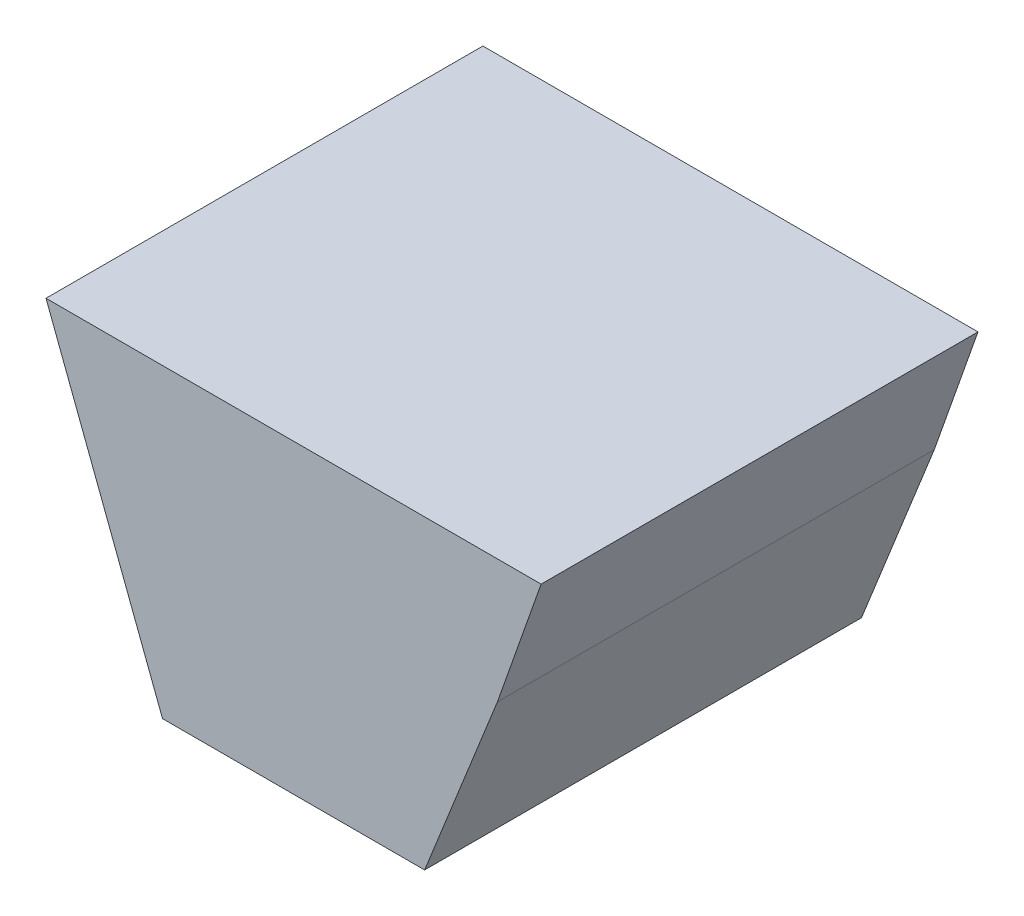
ISO-10303-21;
HEADER;
FILE_DESCRIPTION(('STEP AP214'),'2;1');
FILE_NAME('part.step','',(''),(''),'','','');
FILE_SCHEMA(('AUTOMOTIVE_DESIGN { 1 0 10303 214 1 1 1 1 }'));
ENDSEC;
DATA;
#1=APPLICATION_CONTEXT('core data for automotive mechanical design processes');
#2=APPLICATION_PROTOCOL_DEFINITION('international standard','automotive_design',2000,#1);
#3=PRODUCT_CONTEXT('',#1,'mechanical');
#4=PRODUCT('Part','Part','',(#3));
#5=PRODUCT_RELATED_PRODUCT_CATEGORY('part','',(#4));
#6=PRODUCT_DEFINITION_FORMATION('','',#4);
#7=PRODUCT_DEFINITION_CONTEXT('part definition',#1,'design');
#8=PRODUCT_DEFINITION('design','',#6,#7);
#9=PRODUCT_DEFINITION_SHAPE('','',#8);
#10=(LENGTH_UNIT() NAMED_UNIT(*) SI_UNIT(.MILLI.,.METRE.));
#11=(NAMED_UNIT(*) PLANE_ANGLE_UNIT() SI_UNIT($,.RADIAN.));
#12=(NAMED_UNIT(*) SI_UNIT($,.STERADIAN.) SOLID_ANGLE_UNIT());
#13=UNCERTAINTY_MEASURE_WITH_UNIT(LENGTH_MEASURE(1.E-05),#10,'distance_accuracy_value','');
#14=(GEOMETRIC_REPRESENTATION_CONTEXT(3) GLOBAL_UNCERTAINTY_ASSIGNED_CONTEXT((#13)) GLOBAL_UNIT_ASSIGNED_CONTEXT((#10,
#11,#12)) REPRESENTATION_CONTEXT('',''));
#15=CARTESIAN_POINT('',(0.,0.,0.));
#16=DIRECTION('',(0.,0.,1.));
#17=DIRECTION('',(1.,0.,0.));
#18=AXIS2_PLACEMENT_3D('',#15,#16,#17);
#19=CARTESIAN_POINT('',(2.286,-2.667,0.));
#20=DIRECTION('',(0.,-1.,0.));
#21=DIRECTION('',(0.,0.,-1.));
#22=AXIS2_PLACEMENT_3D('',#19,#20,#21);
#23=PLANE('',#22);
#24=DIRECTION('',(0.,0.,1.));
#25=VECTOR('',#24,1.);
#26=CARTESIAN_POINT('',(-2.286,-2.667,0.));
#27=LINE('',#26,#25);
#28=CARTESIAN_POINT('',(-2.286,-2.667,0.));
#29=VERTEX_POINT('',#28);
#30=CARTESIAN_POINT('',(-2.286,-2.667,7.62));
#31=VERTEX_POINT('',#30);
#32=EDGE_CURVE('E66',#29,#31,#27,.T.);
#33=ORIENTED_EDGE('',*,*,#32,.F.);
#34=DIRECTION('',(1.,0.,0.));
#35=VECTOR('',#34,1.);
#36=CARTESIAN_POINT('',(4.318,-2.667,0.));
#37=LINE('',#36,#35);
#38=CARTESIAN_POINT('',(2.286,-2.667,0.));
#39=VERTEX_POINT('',#38);
#40=EDGE_CURVE('E92',#29,#39,#37,.T.);
#41=ORIENTED_EDGE('',*,*,#40,.T.);
#42=DIRECTION('',(0.,0.,1.));
#43=VECTOR('',#42,1.);
#44=CARTESIAN_POINT('',(2.286,-2.667,0.));
#45=LINE('',#44,#43);
#46=CARTESIAN_POINT('',(2.286,-2.667,7.62));
#47=VERTEX_POINT('',#46);
#48=EDGE_CURVE('E20',#47,#39,#45,.F.);
#49=ORIENTED_EDGE('',*,*,#48,.F.);
#50=DIRECTION('',(1.,0.,0.));
#51=VECTOR('',#50,1.);
#52=CARTESIAN_POINT('',(4.318,-2.667,7.62));
#53=LINE('',#52,#51);
#54=EDGE_CURVE('E75',#31,#47,#53,.T.);
#55=ORIENTED_EDGE('',*,*,#54,.F.);
#56=EDGE_LOOP('',(#33,#41,#49,#55));
#57=FACE_BOUND('',#56,.T.);
#58=ADVANCED_FACE('F17',(#57),#23,.T.);
#59=CARTESIAN_POINT('',(3.556,0.508,0.));
#60=DIRECTION('',(0.928476690885259,-0.371390676354104,0.));
#61=DIRECTION('',(0.371390676354104,0.928476690885259,0.));
#62=AXIS2_PLACEMENT_3D('',#59,#60,#61);
#63=PLANE('',#62);
#64=ORIENTED_EDGE('',*,*,#48,.T.);
#65=DIRECTION('',(0.371390676354104,0.928476690885259,0.));
#66=VECTOR('',#65,1.);
#67=CARTESIAN_POINT('',(2.286,-2.667,0.));
#68=LINE('',#67,#66);
#69=CARTESIAN_POINT('',(3.55600000000012,0.50800000000006,0.));
#70=VERTEX_POINT('',#69);
#71=EDGE_CURVE('E94',#39,#70,#68,.T.);
#72=ORIENTED_EDGE('',*,*,#71,.T.);
#73=DIRECTION('',(0.,0.,1.));
#74=VECTOR('',#73,1.);
#75=CARTESIAN_POINT('',(3.55600000000036,0.507999999999873,0.));
#76=LINE('',#75,#74);
#77=CARTESIAN_POINT('',(3.55600000000016,0.508000000000151,7.62));
#78=VERTEX_POINT('',#77);
#79=EDGE_CURVE('E89',#78,#70,#76,.F.);
#80=ORIENTED_EDGE('',*,*,#79,.F.);
#81=DIRECTION('',(0.371390676354104,0.928476690885259,0.));
#82=VECTOR('',#81,1.);
#83=CARTESIAN_POINT('',(2.286,-2.667,7.62));
#84=LINE('',#83,#82);
#85=EDGE_CURVE('E77',#47,#78,#84,.T.);
#86=ORIENTED_EDGE('',*,*,#85,.F.);
#87=EDGE_LOOP('',(#64,#72,#80,#86));
#88=FACE_BOUND('',#87,.T.);
#89=ADVANCED_FACE('F106',(#88),#63,.T.);
#90=CARTESIAN_POINT('',(-2.286,-2.667,0.));
#91=DIRECTION('',(-0.934487734928968,-0.355995327591988,0.));
#92=DIRECTION('',(0.355995327591988,-0.934487734928968,0.));
#93=AXIS2_PLACEMENT_3D('',#90,#91,#92);
#94=PLANE('',#93);
#95=DIRECTION('',(0.,0.,1.));
#96=VECTOR('',#95,1.);
#97=CARTESIAN_POINT('',(-4.318,2.667,0.));
#98=LINE('',#97,#96);
#99=CARTESIAN_POINT('',(-4.318,2.667,0.));
#100=VERTEX_POINT('',#99);
#101=CARTESIAN_POINT('',(-4.318,2.667,7.62));
#102=VERTEX_POINT('',#101);
#103=EDGE_CURVE('E97',#100,#102,#98,.T.);
#104=ORIENTED_EDGE('',*,*,#103,.F.);
#105=DIRECTION('',(0.355995327591988,-0.934487734928968,0.));
#106=VECTOR('',#105,1.);
#107=CARTESIAN_POINT('',(-4.318,2.667,0.));
#108=LINE('',#107,#106);
#109=EDGE_CURVE('E72',#100,#29,#108,.T.);
#110=ORIENTED_EDGE('',*,*,#109,.T.);
#111=ORIENTED_EDGE('',*,*,#32,.T.);
#112=DIRECTION('',(0.355995327591988,-0.934487734928968,0.));
#113=VECTOR('',#112,1.);
#114=CARTESIAN_POINT('',(-4.318,2.667,7.62));
#115=LINE('',#114,#113);
#116=EDGE_CURVE('E69',#102,#31,#115,.T.);
#117=ORIENTED_EDGE('',*,*,#116,.F.);
#118=EDGE_LOOP('',(#104,#110,#111,#117));
#119=FACE_BOUND('',#118,.T.);
#120=ADVANCED_FACE('F67',(#119),#94,.T.);
#121=CARTESIAN_POINT('',(4.318,2.667,7.62));
#122=DIRECTION('',(0.,0.,1.));
#123=DIRECTION('',(1.,0.,0.));
#124=AXIS2_PLACEMENT_3D('',#121,#122,#123);
#125=PLANE('',#124);
#126=ORIENTED_EDGE('',*,*,#85,.T.);
#127=DIRECTION('',(0.332820117734981,0.942990333582945,0.));
#128=VECTOR('',#127,1.);
#129=CARTESIAN_POINT('',(4.318,2.667,7.62));
#130=LINE('',#129,#128);
#131=CARTESIAN_POINT('',(4.318,2.667,7.62));
#132=VERTEX_POINT('',#131);
#133=EDGE_CURVE('E86',#132,#78,#130,.F.);
#134=ORIENTED_EDGE('',*,*,#133,.F.);
#135=DIRECTION('',(1.,0.,0.));
#136=VECTOR('',#135,1.);
#137=CARTESIAN_POINT('',(-4.318,2.667,7.62));
#138=LINE('',#137,#136);
#139=EDGE_CURVE('E81',#102,#132,#138,.T.);
#140=ORIENTED_EDGE('',*,*,#139,.F.);
#141=ORIENTED_EDGE('',*,*,#116,.T.);
#142=ORIENTED_EDGE('',*,*,#54,.T.);
#143=EDGE_LOOP('',(#126,#134,#140,#141,#142));
#144=FACE_BOUND('',#143,.T.);
#145=ADVANCED_FACE('F79',(#144),#125,.T.);
#146=CARTESIAN_POINT('',(4.318,2.667,0.));
#147=DIRECTION('',(0.942990333582945,-0.332820117734981,0.));
#148=DIRECTION('',(0.332820117734981,0.942990333582945,0.));
#149=AXIS2_PLACEMENT_3D('',#146,#147,#148);
#150=PLANE('',#149);
#151=ORIENTED_EDGE('',*,*,#79,.T.);
#152=DIRECTION('',(0.332820117735137,0.942990333582889,0.));
#153=VECTOR('',#152,1.);
#154=CARTESIAN_POINT('',(3.556,0.508,0.));
#155=LINE('',#154,#153);
#156=CARTESIAN_POINT('',(4.318,2.667,0.));
#157=VERTEX_POINT('',#156);
#158=EDGE_CURVE('E35',#70,#157,#155,.T.);
#159=ORIENTED_EDGE('',*,*,#158,.T.);
#160=DIRECTION('',(0.,0.,1.));
#161=VECTOR('',#160,1.);
#162=CARTESIAN_POINT('',(4.318,2.667,0.));
#163=LINE('',#162,#161);
#164=EDGE_CURVE('E26',#132,#157,#163,.F.);
#165=ORIENTED_EDGE('',*,*,#164,.F.);
#166=ORIENTED_EDGE('',*,*,#133,.T.);
#167=EDGE_LOOP('',(#151,#159,#165,#166));
#168=FACE_BOUND('',#167,.T.);
#169=ADVANCED_FACE('F103',(#168),#150,.T.);
#170=CARTESIAN_POINT('',(4.318,2.667,0.));
#171=DIRECTION('',(0.,0.,1.));
#172=DIRECTION('',(1.,0.,0.));
#173=AXIS2_PLACEMENT_3D('',#170,#171,#172);
#174=PLANE('',#173);
#175=ORIENTED_EDGE('',*,*,#71,.F.);
#176=ORIENTED_EDGE('',*,*,#40,.F.);
#177=ORIENTED_EDGE('',*,*,#109,.F.);
#178=DIRECTION('',(1.,0.,0.));
#179=VECTOR('',#178,1.);
#180=CARTESIAN_POINT('',(-4.318,2.667,0.));
#181=LINE('',#180,#179);
#182=EDGE_CURVE('E11',#157,#100,#181,.F.);
#183=ORIENTED_EDGE('',*,*,#182,.F.);
#184=ORIENTED_EDGE('',*,*,#158,.F.);
#185=EDGE_LOOP('',(#175,#176,#177,#183,#184));
#186=FACE_BOUND('',#185,.T.);
#187=ADVANCED_FACE('F109',(#186),#174,.F.);
#188=CARTESIAN_POINT('',(-4.318,2.667,0.));
#189=DIRECTION('',(0.,1.,0.));
#190=DIRECTION('',(0.,0.,1.));
#191=AXIS2_PLACEMENT_3D('',#188,#189,#190);
#192=PLANE('',#191);
#193=ORIENTED_EDGE('',*,*,#164,.T.);
#194=ORIENTED_EDGE('',*,*,#182,.T.);
#195=ORIENTED_EDGE('',*,*,#103,.T.);
#196=ORIENTED_EDGE('',*,*,#139,.T.);
#197=EDGE_LOOP('',(#193,#194,#195,#196));
#198=FACE_BOUND('',#197,.T.);
#199=ADVANCED_FACE('F102',(#198),#192,.T.);
#200=CLOSED_SHELL('',(#58,#89,#120,#145,#169,#187,#199));
#201=MANIFOLD_SOLID_BREP('B1',#200);
#202=ADVANCED_BREP_SHAPE_REPRESENTATION('',(#18,#201),#14);
#203=SHAPE_DEFINITION_REPRESENTATION(#9,#202);
ENDSEC;
END-ISO-10303-21;
